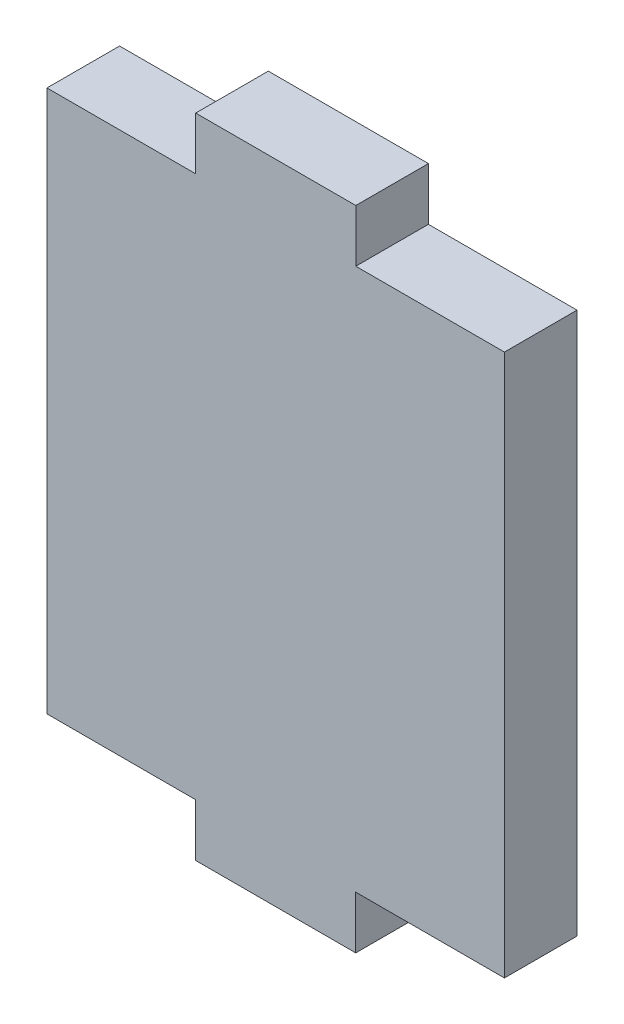
ISO-10303-21;
HEADER;
FILE_DESCRIPTION(('STEP AP214'),'2;1');
FILE_NAME('part.step','',(''),(''),'','','');
FILE_SCHEMA(('AUTOMOTIVE_DESIGN { 1 0 10303 214 1 1 1 1 }'));
ENDSEC;
DATA;
#1=APPLICATION_CONTEXT('core data for automotive mechanical design processes');
#2=APPLICATION_PROTOCOL_DEFINITION('international standard','automotive_design',2000,#1);
#3=PRODUCT_CONTEXT('',#1,'mechanical');
#4=PRODUCT('Part','Part','',(#3));
#5=PRODUCT_RELATED_PRODUCT_CATEGORY('part','',(#4));
#6=PRODUCT_DEFINITION_FORMATION('','',#4);
#7=PRODUCT_DEFINITION_CONTEXT('part definition',#1,'design');
#8=PRODUCT_DEFINITION('design','',#6,#7);
#9=PRODUCT_DEFINITION_SHAPE('','',#8);
#10=(LENGTH_UNIT() NAMED_UNIT(*) SI_UNIT(.MILLI.,.METRE.));
#11=(NAMED_UNIT(*) PLANE_ANGLE_UNIT() SI_UNIT($,.RADIAN.));
#12=(NAMED_UNIT(*) SI_UNIT($,.STERADIAN.) SOLID_ANGLE_UNIT());
#13=UNCERTAINTY_MEASURE_WITH_UNIT(LENGTH_MEASURE(1.E-05),#10,'distance_accuracy_value','');
#14=(GEOMETRIC_REPRESENTATION_CONTEXT(3) GLOBAL_UNCERTAINTY_ASSIGNED_CONTEXT((#13)) GLOBAL_UNIT_ASSIGNED_CONTEXT((#10,
#11,#12)) REPRESENTATION_CONTEXT('',''));
#15=CARTESIAN_POINT('',(0.,0.,0.));
#16=DIRECTION('',(0.,0.,1.));
#17=DIRECTION('',(1.,0.,0.));
#18=AXIS2_PLACEMENT_3D('',#15,#16,#17);
#19=CARTESIAN_POINT('',(0.,0.,3.175));
#20=DIRECTION('',(0.,1.,0.));
#21=DIRECTION('',(0.,0.,1.));
#22=AXIS2_PLACEMENT_3D('',#19,#20,#21);
#23=PLANE('',#22);
#24=DIRECTION('',(0.,0.,1.));
#25=VECTOR('',#24,1.);
#26=CARTESIAN_POINT('',(13.5,0.,0.));
#27=LINE('',#26,#25);
#28=CARTESIAN_POINT('',(13.5,0.,0.));
#29=VERTEX_POINT('',#28);
#30=CARTESIAN_POINT('',(13.5,0.,3.175));
#31=VERTEX_POINT('',#30);
#32=EDGE_CURVE('E168',#29,#31,#27,.T.);
#33=ORIENTED_EDGE('',*,*,#32,.F.);
#34=DIRECTION('',(1.,0.,0.));
#35=VECTOR('',#34,1.);
#36=CARTESIAN_POINT('',(0.,0.,0.));
#37=LINE('',#36,#35);
#38=CARTESIAN_POINT('',(20.,0.,0.));
#39=VERTEX_POINT('',#38);
#40=EDGE_CURVE('E228',#29,#39,#37,.T.);
#41=ORIENTED_EDGE('',*,*,#40,.T.);
#42=DIRECTION('',(0.,0.,-1.));
#43=VECTOR('',#42,1.);
#44=CARTESIAN_POINT('',(20.,0.,3.175));
#45=LINE('',#44,#43);
#46=CARTESIAN_POINT('',(20.,0.,3.175));
#47=VERTEX_POINT('',#46);
#48=EDGE_CURVE('E48',#47,#39,#45,.T.);
#49=ORIENTED_EDGE('',*,*,#48,.F.);
#50=DIRECTION('',(1.,0.,0.));
#51=VECTOR('',#50,1.);
#52=CARTESIAN_POINT('',(0.,0.,3.175));
#53=LINE('',#52,#51);
#54=EDGE_CURVE('E210',#31,#47,#53,.T.);
#55=ORIENTED_EDGE('',*,*,#54,.F.);
#56=EDGE_LOOP('',(#33,#41,#49,#55));
#57=FACE_BOUND('',#56,.T.);
#58=ADVANCED_FACE('F39',(#57),#23,.F.);
#59=CARTESIAN_POINT('',(0.,23.7,3.175));
#60=DIRECTION('',(0.,-1.,0.));
#61=DIRECTION('',(0.,0.,-1.));
#62=AXIS2_PLACEMENT_3D('',#59,#60,#61);
#63=PLANE('',#62);
#64=DIRECTION('',(0.,0.,1.));
#65=VECTOR('',#64,1.);
#66=CARTESIAN_POINT('',(6.502051165,23.7,0.));
#67=LINE('',#66,#65);
#68=CARTESIAN_POINT('',(6.502051165,23.7,0.));
#69=VERTEX_POINT('',#68);
#70=CARTESIAN_POINT('',(6.502051165,23.7,3.175));
#71=VERTEX_POINT('',#70);
#72=EDGE_CURVE('E185',#69,#71,#67,.T.);
#73=ORIENTED_EDGE('',*,*,#72,.F.);
#74=DIRECTION('',(-1.,0.,0.));
#75=VECTOR('',#74,1.);
#76=CARTESIAN_POINT('',(0.,23.7,0.));
#77=LINE('',#76,#75);
#78=CARTESIAN_POINT('',(0.,23.7,0.));
#79=VERTEX_POINT('',#78);
#80=EDGE_CURVE('E235',#69,#79,#77,.T.);
#81=ORIENTED_EDGE('',*,*,#80,.T.);
#82=DIRECTION('',(0.,0.,-1.));
#83=VECTOR('',#82,1.);
#84=CARTESIAN_POINT('',(0.,23.7,3.175));
#85=LINE('',#84,#83);
#86=CARTESIAN_POINT('',(0.,23.7,3.175));
#87=VERTEX_POINT('',#86);
#88=EDGE_CURVE('E224',#87,#79,#85,.T.);
#89=ORIENTED_EDGE('',*,*,#88,.F.);
#90=DIRECTION('',(-1.,0.,0.));
#91=VECTOR('',#90,1.);
#92=CARTESIAN_POINT('',(0.,23.7,3.175));
#93=LINE('',#92,#91);
#94=EDGE_CURVE('E219',#71,#87,#93,.T.);
#95=ORIENTED_EDGE('',*,*,#94,.F.);
#96=EDGE_LOOP('',(#73,#81,#89,#95));
#97=FACE_BOUND('',#96,.T.);
#98=ADVANCED_FACE('F282',(#97),#63,.F.);
#99=CARTESIAN_POINT('',(0.,0.,3.175));
#100=DIRECTION('',(1.,0.,0.));
#101=DIRECTION('',(0.,0.,-1.));
#102=AXIS2_PLACEMENT_3D('',#99,#100,#101);
#103=PLANE('',#102);
#104=DIRECTION('',(0.,-1.,0.));
#105=VECTOR('',#104,1.);
#106=CARTESIAN_POINT('',(0.,0.,0.));
#107=LINE('',#106,#105);
#108=CARTESIAN_POINT('',(0.,0.,0.));
#109=VERTEX_POINT('',#108);
#110=EDGE_CURVE('E197',#79,#109,#107,.T.);
#111=ORIENTED_EDGE('',*,*,#110,.T.);
#112=DIRECTION('',(0.,0.,-1.));
#113=VECTOR('',#112,1.);
#114=CARTESIAN_POINT('',(0.,0.,3.175));
#115=LINE('',#114,#113);
#116=CARTESIAN_POINT('',(0.,0.,3.175));
#117=VERTEX_POINT('',#116);
#118=EDGE_CURVE('E11',#117,#109,#115,.T.);
#119=ORIENTED_EDGE('',*,*,#118,.F.);
#120=DIRECTION('',(0.,-1.,0.));
#121=VECTOR('',#120,1.);
#122=CARTESIAN_POINT('',(0.,0.,3.175));
#123=LINE('',#122,#121);
#124=EDGE_CURVE('E206',#87,#117,#123,.T.);
#125=ORIENTED_EDGE('',*,*,#124,.F.);
#126=ORIENTED_EDGE('',*,*,#88,.T.);
#127=EDGE_LOOP('',(#111,#119,#125,#126));
#128=FACE_BOUND('',#127,.T.);
#129=ADVANCED_FACE('F41',(#128),#103,.F.);
#130=CARTESIAN_POINT('',(6.5,0.,0.));
#131=VERTEX_POINT('',#130);
#132=EDGE_CURVE('E229',#109,#131,#37,.T.);
#133=ORIENTED_EDGE('',*,*,#132,.T.);
#134=DIRECTION('',(0.,0.,1.));
#135=VECTOR('',#134,1.);
#136=CARTESIAN_POINT('',(6.5,0.,0.));
#137=LINE('',#136,#135);
#138=CARTESIAN_POINT('',(6.5,0.,3.175));
#139=VERTEX_POINT('',#138);
#140=EDGE_CURVE('E151',#131,#139,#137,.T.);
#141=ORIENTED_EDGE('',*,*,#140,.T.);
#142=EDGE_CURVE('E212',#117,#139,#53,.T.);
#143=ORIENTED_EDGE('',*,*,#142,.F.);
#144=ORIENTED_EDGE('',*,*,#118,.T.);
#145=EDGE_LOOP('',(#133,#141,#143,#144));
#146=FACE_BOUND('',#145,.T.);
#147=ADVANCED_FACE('F274',(#146),#23,.F.);
#148=CARTESIAN_POINT('',(20.,0.,3.175));
#149=DIRECTION('',(-1.,0.,0.));
#150=DIRECTION('',(0.,0.,1.));
#151=AXIS2_PLACEMENT_3D('',#148,#149,#150);
#152=PLANE('',#151);
#153=DIRECTION('',(0.,1.,0.));
#154=VECTOR('',#153,1.);
#155=CARTESIAN_POINT('',(20.,0.,0.));
#156=LINE('',#155,#154);
#157=CARTESIAN_POINT('',(20.,23.7,0.));
#158=VERTEX_POINT('',#157);
#159=EDGE_CURVE('E232',#39,#158,#156,.T.);
#160=ORIENTED_EDGE('',*,*,#159,.T.);
#161=DIRECTION('',(0.,0.,-1.));
#162=VECTOR('',#161,1.);
#163=CARTESIAN_POINT('',(20.,23.7,3.175));
#164=LINE('',#163,#162);
#165=CARTESIAN_POINT('',(20.,23.7,3.175));
#166=VERTEX_POINT('',#165);
#167=EDGE_CURVE('E242',#166,#158,#164,.T.);
#168=ORIENTED_EDGE('',*,*,#167,.F.);
#169=DIRECTION('',(0.,1.,0.));
#170=VECTOR('',#169,1.);
#171=CARTESIAN_POINT('',(20.,0.,3.175));
#172=LINE('',#171,#170);
#173=EDGE_CURVE('E216',#47,#166,#172,.T.);
#174=ORIENTED_EDGE('',*,*,#173,.F.);
#175=ORIENTED_EDGE('',*,*,#48,.T.);
#176=EDGE_LOOP('',(#160,#168,#174,#175));
#177=FACE_BOUND('',#176,.T.);
#178=ADVANCED_FACE('F251',(#177),#152,.F.);
#179=CARTESIAN_POINT('',(13.502051165,23.7,0.));
#180=VERTEX_POINT('',#179);
#181=EDGE_CURVE('E211',#158,#180,#77,.T.);
#182=ORIENTED_EDGE('',*,*,#181,.T.);
#183=DIRECTION('',(0.,0.,1.));
#184=VECTOR('',#183,1.);
#185=CARTESIAN_POINT('',(13.502051165,23.7,0.));
#186=LINE('',#185,#184);
#187=CARTESIAN_POINT('',(13.502051165,23.7,3.175));
#188=VERTEX_POINT('',#187);
#189=EDGE_CURVE('E201',#180,#188,#186,.T.);
#190=ORIENTED_EDGE('',*,*,#189,.T.);
#191=EDGE_CURVE('E220',#166,#188,#93,.T.);
#192=ORIENTED_EDGE('',*,*,#191,.F.);
#193=ORIENTED_EDGE('',*,*,#167,.T.);
#194=EDGE_LOOP('',(#182,#190,#192,#193));
#195=FACE_BOUND('',#194,.T.);
#196=ADVANCED_FACE('F259',(#195),#63,.F.);
#197=CARTESIAN_POINT('',(0.,0.,3.175));
#198=DIRECTION('',(0.,0.,-1.));
#199=DIRECTION('',(-1.,0.,0.));
#200=AXIS2_PLACEMENT_3D('',#197,#198,#199);
#201=PLANE('',#200);
#202=ORIENTED_EDGE('',*,*,#124,.T.);
#203=ORIENTED_EDGE('',*,*,#142,.T.);
#204=DIRECTION('',(0.,-1.,0.));
#205=VECTOR('',#204,1.);
#206=CARTESIAN_POINT('',(6.5,0.,3.175));
#207=LINE('',#206,#205);
#208=CARTESIAN_POINT('',(6.5,-2.3,3.175));
#209=VERTEX_POINT('',#208);
#210=EDGE_CURVE('E55',#139,#209,#207,.T.);
#211=ORIENTED_EDGE('',*,*,#210,.T.);
#212=DIRECTION('',(1.,0.,0.));
#213=VECTOR('',#212,1.);
#214=CARTESIAN_POINT('',(6.5,-2.3,3.175));
#215=LINE('',#214,#213);
#216=CARTESIAN_POINT('',(13.5,-2.3,3.175));
#217=VERTEX_POINT('',#216);
#218=EDGE_CURVE('E134',#209,#217,#215,.T.);
#219=ORIENTED_EDGE('',*,*,#218,.T.);
#220=DIRECTION('',(0.,1.,0.));
#221=VECTOR('',#220,1.);
#222=CARTESIAN_POINT('',(13.5,0.,3.175));
#223=LINE('',#222,#221);
#224=EDGE_CURVE('E153',#217,#31,#223,.T.);
#225=ORIENTED_EDGE('',*,*,#224,.T.);
#226=ORIENTED_EDGE('',*,*,#54,.T.);
#227=ORIENTED_EDGE('',*,*,#173,.T.);
#228=ORIENTED_EDGE('',*,*,#191,.T.);
#229=DIRECTION('',(0.,1.,0.));
#230=VECTOR('',#229,1.);
#231=CARTESIAN_POINT('',(13.502051165,23.7,3.175));
#232=LINE('',#231,#230);
#233=CARTESIAN_POINT('',(13.502051165,26.,3.175));
#234=VERTEX_POINT('',#233);
#235=EDGE_CURVE('E63',#188,#234,#232,.T.);
#236=ORIENTED_EDGE('',*,*,#235,.T.);
#237=DIRECTION('',(-1.,0.,0.));
#238=VECTOR('',#237,1.);
#239=CARTESIAN_POINT('',(6.502051165,26.,3.175));
#240=LINE('',#239,#238);
#241=CARTESIAN_POINT('',(6.502051165,26.,3.175));
#242=VERTEX_POINT('',#241);
#243=EDGE_CURVE('E177',#234,#242,#240,.T.);
#244=ORIENTED_EDGE('',*,*,#243,.T.);
#245=DIRECTION('',(0.,-1.,0.));
#246=VECTOR('',#245,1.);
#247=CARTESIAN_POINT('',(6.502051165,23.7,3.175));
#248=LINE('',#247,#246);
#249=EDGE_CURVE('E167',#242,#71,#248,.T.);
#250=ORIENTED_EDGE('',*,*,#249,.T.);
#251=ORIENTED_EDGE('',*,*,#94,.T.);
#252=EDGE_LOOP('',(#202,#203,#211,#219,#225,#226,#227,#228,#236,#244,#250,#251));
#253=FACE_BOUND('',#252,.T.);
#254=ADVANCED_FACE('F262',(#253),#201,.F.);
#255=CARTESIAN_POINT('',(0.,0.,0.));
#256=DIRECTION('',(0.,0.,-1.));
#257=DIRECTION('',(-1.,0.,0.));
#258=AXIS2_PLACEMENT_3D('',#255,#256,#257);
#259=PLANE('',#258);
#260=ORIENTED_EDGE('',*,*,#110,.F.);
#261=ORIENTED_EDGE('',*,*,#80,.F.);
#262=DIRECTION('',(0.,-1.,0.));
#263=VECTOR('',#262,1.);
#264=CARTESIAN_POINT('',(6.502051165,23.7,0.));
#265=LINE('',#264,#263);
#266=CARTESIAN_POINT('',(6.502051165,26.,0.));
#267=VERTEX_POINT('',#266);
#268=EDGE_CURVE('E173',#267,#69,#265,.T.);
#269=ORIENTED_EDGE('',*,*,#268,.F.);
#270=DIRECTION('',(-1.,0.,0.));
#271=VECTOR('',#270,1.);
#272=CARTESIAN_POINT('',(6.502051165,26.,0.));
#273=LINE('',#272,#271);
#274=CARTESIAN_POINT('',(13.502051165,26.,0.));
#275=VERTEX_POINT('',#274);
#276=EDGE_CURVE('E181',#275,#267,#273,.T.);
#277=ORIENTED_EDGE('',*,*,#276,.F.);
#278=DIRECTION('',(0.,1.,0.));
#279=VECTOR('',#278,1.);
#280=CARTESIAN_POINT('',(13.502051165,23.7,0.));
#281=LINE('',#280,#279);
#282=EDGE_CURVE('E176',#180,#275,#281,.T.);
#283=ORIENTED_EDGE('',*,*,#282,.F.);
#284=ORIENTED_EDGE('',*,*,#181,.F.);
#285=ORIENTED_EDGE('',*,*,#159,.F.);
#286=ORIENTED_EDGE('',*,*,#40,.F.);
#287=DIRECTION('',(0.,1.,0.));
#288=VECTOR('',#287,1.);
#289=CARTESIAN_POINT('',(13.5,0.,0.));
#290=LINE('',#289,#288);
#291=CARTESIAN_POINT('',(13.5,-2.3,0.));
#292=VERTEX_POINT('',#291);
#293=EDGE_CURVE('E138',#292,#29,#290,.T.);
#294=ORIENTED_EDGE('',*,*,#293,.F.);
#295=DIRECTION('',(1.,0.,0.));
#296=VECTOR('',#295,1.);
#297=CARTESIAN_POINT('',(6.5,-2.3,0.));
#298=LINE('',#297,#296);
#299=CARTESIAN_POINT('',(6.5,-2.3,0.));
#300=VERTEX_POINT('',#299);
#301=EDGE_CURVE('E132',#300,#292,#298,.T.);
#302=ORIENTED_EDGE('',*,*,#301,.F.);
#303=DIRECTION('',(0.,-1.,0.));
#304=VECTOR('',#303,1.);
#305=CARTESIAN_POINT('',(6.5,0.,0.));
#306=LINE('',#305,#304);
#307=EDGE_CURVE('E145',#131,#300,#306,.T.);
#308=ORIENTED_EDGE('',*,*,#307,.F.);
#309=ORIENTED_EDGE('',*,*,#132,.F.);
#310=EDGE_LOOP('',(#260,#261,#269,#277,#283,#284,#285,#286,#294,#302,#308,#309));
#311=FACE_BOUND('',#310,.T.);
#312=ADVANCED_FACE('F144',(#311),#259,.T.);
#313=CARTESIAN_POINT('',(6.502051165,23.7,0.));
#314=DIRECTION('',(-1.,0.,0.));
#315=DIRECTION('',(0.,-1.,0.));
#316=AXIS2_PLACEMENT_3D('',#313,#314,#315);
#317=PLANE('',#316);
#318=ORIENTED_EDGE('',*,*,#249,.F.);
#319=DIRECTION('',(0.,0.,1.));
#320=VECTOR('',#319,1.);
#321=CARTESIAN_POINT('',(6.502051165,26.,0.));
#322=LINE('',#321,#320);
#323=EDGE_CURVE('E194',#267,#242,#322,.T.);
#324=ORIENTED_EDGE('',*,*,#323,.F.);
#325=ORIENTED_EDGE('',*,*,#268,.T.);
#326=ORIENTED_EDGE('',*,*,#72,.T.);
#327=EDGE_LOOP('',(#318,#324,#325,#326));
#328=FACE_BOUND('',#327,.T.);
#329=ADVANCED_FACE('F285',(#328),#317,.T.);
#330=CARTESIAN_POINT('',(6.502051165,26.,0.));
#331=DIRECTION('',(0.,1.,0.));
#332=DIRECTION('',(0.,0.,1.));
#333=AXIS2_PLACEMENT_3D('',#330,#331,#332);
#334=PLANE('',#333);
#335=ORIENTED_EDGE('',*,*,#243,.F.);
#336=DIRECTION('',(0.,0.,1.));
#337=VECTOR('',#336,1.);
#338=CARTESIAN_POINT('',(13.502051165,26.,0.));
#339=LINE('',#338,#337);
#340=EDGE_CURVE('E198',#275,#234,#339,.T.);
#341=ORIENTED_EDGE('',*,*,#340,.F.);
#342=ORIENTED_EDGE('',*,*,#276,.T.);
#343=ORIENTED_EDGE('',*,*,#323,.T.);
#344=EDGE_LOOP('',(#335,#341,#342,#343));
#345=FACE_BOUND('',#344,.T.);
#346=ADVANCED_FACE('F287',(#345),#334,.T.);
#347=CARTESIAN_POINT('',(13.502051165,23.7,0.));
#348=DIRECTION('',(1.,0.,0.));
#349=DIRECTION('',(0.,0.,-1.));
#350=AXIS2_PLACEMENT_3D('',#347,#348,#349);
#351=PLANE('',#350);
#352=ORIENTED_EDGE('',*,*,#235,.F.);
#353=ORIENTED_EDGE('',*,*,#189,.F.);
#354=ORIENTED_EDGE('',*,*,#282,.T.);
#355=ORIENTED_EDGE('',*,*,#340,.T.);
#356=EDGE_LOOP('',(#352,#353,#354,#355));
#357=FACE_BOUND('',#356,.T.);
#358=ADVANCED_FACE('F288',(#357),#351,.T.);
#359=CARTESIAN_POINT('',(6.5,0.,0.));
#360=DIRECTION('',(-1.,0.,0.));
#361=DIRECTION('',(0.,0.,1.));
#362=AXIS2_PLACEMENT_3D('',#359,#360,#361);
#363=PLANE('',#362);
#364=ORIENTED_EDGE('',*,*,#210,.F.);
#365=ORIENTED_EDGE('',*,*,#140,.F.);
#366=ORIENTED_EDGE('',*,*,#307,.T.);
#367=DIRECTION('',(0.,0.,1.));
#368=VECTOR('',#367,1.);
#369=CARTESIAN_POINT('',(6.5,-2.3,0.));
#370=LINE('',#369,#368);
#371=EDGE_CURVE('E129',#300,#209,#370,.T.);
#372=ORIENTED_EDGE('',*,*,#371,.T.);
#373=EDGE_LOOP('',(#364,#365,#366,#372));
#374=FACE_BOUND('',#373,.T.);
#375=ADVANCED_FACE('F150',(#374),#363,.T.);
#376=CARTESIAN_POINT('',(13.5,0.,0.));
#377=DIRECTION('',(1.,0.,0.));
#378=DIRECTION('',(0.,0.,-1.));
#379=AXIS2_PLACEMENT_3D('',#376,#377,#378);
#380=PLANE('',#379);
#381=ORIENTED_EDGE('',*,*,#224,.F.);
#382=DIRECTION('',(0.,0.,1.));
#383=VECTOR('',#382,1.);
#384=CARTESIAN_POINT('',(13.5,-2.3,0.));
#385=LINE('',#384,#383);
#386=EDGE_CURVE('E137',#292,#217,#385,.T.);
#387=ORIENTED_EDGE('',*,*,#386,.F.);
#388=ORIENTED_EDGE('',*,*,#293,.T.);
#389=ORIENTED_EDGE('',*,*,#32,.T.);
#390=EDGE_LOOP('',(#381,#387,#388,#389));
#391=FACE_BOUND('',#390,.T.);
#392=ADVANCED_FACE('F270',(#391),#380,.T.);
#393=CARTESIAN_POINT('',(6.5,-2.3,0.));
#394=DIRECTION('',(0.,-1.,0.));
#395=DIRECTION('',(0.,0.,-1.));
#396=AXIS2_PLACEMENT_3D('',#393,#394,#395);
#397=PLANE('',#396);
#398=ORIENTED_EDGE('',*,*,#218,.F.);
#399=ORIENTED_EDGE('',*,*,#371,.F.);
#400=ORIENTED_EDGE('',*,*,#301,.T.);
#401=ORIENTED_EDGE('',*,*,#386,.T.);
#402=EDGE_LOOP('',(#398,#399,#400,#401));
#403=FACE_BOUND('',#402,.T.);
#404=ADVANCED_FACE('F131',(#403),#397,.T.);
#405=CLOSED_SHELL('',(#58,#98,#129,#147,#178,#196,#254,#312,#329,#346,#358,#375,#392,#404));
#406=MANIFOLD_SOLID_BREP('B2',#405);
#407=ADVANCED_BREP_SHAPE_REPRESENTATION('',(#18,#406),#14);
#408=SHAPE_DEFINITION_REPRESENTATION(#9,#407);
ENDSEC;
END-ISO-10303-21;
